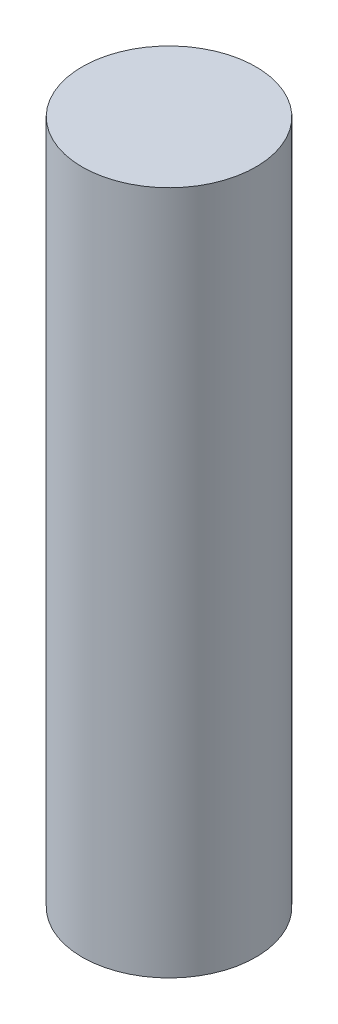
ISO-10303-21;
HEADER;
FILE_DESCRIPTION(('STEP AP214'),'2;1');
FILE_NAME('part.step','',(''),(''),'','','');
FILE_SCHEMA(('AUTOMOTIVE_DESIGN { 1 0 10303 214 1 1 1 1 }'));
ENDSEC;
DATA;
#1=APPLICATION_CONTEXT('core data for automotive mechanical design processes');
#2=APPLICATION_PROTOCOL_DEFINITION('international standard','automotive_design',2000,#1);
#3=PRODUCT_CONTEXT('',#1,'mechanical');
#4=PRODUCT('Part','Part','',(#3));
#5=PRODUCT_RELATED_PRODUCT_CATEGORY('part','',(#4));
#6=PRODUCT_DEFINITION_FORMATION('','',#4);
#7=PRODUCT_DEFINITION_CONTEXT('part definition',#1,'design');
#8=PRODUCT_DEFINITION('design','',#6,#7);
#9=PRODUCT_DEFINITION_SHAPE('','',#8);
#10=(LENGTH_UNIT() NAMED_UNIT(*) SI_UNIT(.MILLI.,.METRE.));
#11=(NAMED_UNIT(*) PLANE_ANGLE_UNIT() SI_UNIT($,.RADIAN.));
#12=(NAMED_UNIT(*) SI_UNIT($,.STERADIAN.) SOLID_ANGLE_UNIT());
#13=UNCERTAINTY_MEASURE_WITH_UNIT(LENGTH_MEASURE(1.E-05),#10,'distance_accuracy_value','');
#14=(GEOMETRIC_REPRESENTATION_CONTEXT(3) GLOBAL_UNCERTAINTY_ASSIGNED_CONTEXT((#13)) GLOBAL_UNIT_ASSIGNED_CONTEXT((#10,
#11,#12)) REPRESENTATION_CONTEXT('',''));
#15=CARTESIAN_POINT('',(0.,0.,0.));
#16=DIRECTION('',(0.,0.,1.));
#17=DIRECTION('',(1.,0.,0.));
#18=AXIS2_PLACEMENT_3D('',#15,#16,#17);
#19=CARTESIAN_POINT('',(0.,98.5,0.));
#20=DIRECTION('',(0.,-1.,0.));
#21=DIRECTION('',(0.,0.,-1.));
#22=AXIS2_PLACEMENT_3D('',#19,#20,#21);
#23=CYLINDRICAL_SURFACE('',#22,12.5);
#24=CARTESIAN_POINT('',(0.,98.5,0.));
#25=DIRECTION('',(0.,1.,0.));
#26=DIRECTION('',(0.,0.,1.));
#27=AXIS2_PLACEMENT_3D('',#24,#25,#26);
#28=CIRCLE('',#27,12.5);
#29=CARTESIAN_POINT('',(0.,98.5,12.5));
#30=VERTEX_POINT('',#29);
#31=EDGE_CURVE('E10',#30,#30,#28,.T.);
#32=ORIENTED_EDGE('',*,*,#31,.F.);
#33=EDGE_LOOP('',(#32));
#34=FACE_BOUND('',#33,.T.);
#35=CARTESIAN_POINT('',(0.,0.,0.));
#36=DIRECTION('',(0.,1.,0.));
#37=DIRECTION('',(0.,0.,1.));
#38=AXIS2_PLACEMENT_3D('',#35,#36,#37);
#39=CIRCLE('',#38,12.5);
#40=CARTESIAN_POINT('',(0.,0.,12.5));
#41=VERTEX_POINT('',#40);
#42=EDGE_CURVE('E46',#41,#41,#39,.T.);
#43=ORIENTED_EDGE('',*,*,#42,.T.);
#44=EDGE_LOOP('',(#43));
#45=FACE_BOUND('',#44,.T.);
#46=ADVANCED_FACE('F43',(#34,#45),#23,.T.);
#47=CARTESIAN_POINT('',(0.,98.5,0.));
#48=DIRECTION('',(0.,1.,0.));
#49=DIRECTION('',(0.,0.,1.));
#50=AXIS2_PLACEMENT_3D('',#47,#48,#49);
#51=PLANE('',#50);
#52=ORIENTED_EDGE('',*,*,#31,.T.);
#53=EDGE_LOOP('',(#52));
#54=FACE_BOUND('',#53,.T.);
#55=ADVANCED_FACE('F76',(#54),#51,.T.);
#56=CARTESIAN_POINT('',(0.,0.,0.));
#57=DIRECTION('',(0.,1.,0.));
#58=DIRECTION('',(0.,0.,1.));
#59=AXIS2_PLACEMENT_3D('',#56,#57,#58);
#60=PLANE('',#59);
#61=CARTESIAN_POINT('',(0.,0.,0.));
#62=DIRECTION('',(0.,-1.,0.));
#63=DIRECTION('',(0.,0.,-1.));
#64=AXIS2_PLACEMENT_3D('',#61,#62,#63);
#65=CIRCLE('',#64,3.175);
#66=CARTESIAN_POINT('',(0.,0.,-3.175));
#67=VERTEX_POINT('',#66);
#68=EDGE_CURVE('E57',#67,#67,#65,.T.);
#69=ORIENTED_EDGE('',*,*,#68,.F.);
#70=EDGE_LOOP('',(#69));
#71=FACE_BOUND('',#70,.T.);
#72=ORIENTED_EDGE('',*,*,#42,.F.);
#73=EDGE_LOOP('',(#72));
#74=FACE_BOUND('',#73,.T.);
#75=ADVANCED_FACE('F70',(#71,#74),#60,.F.);
#76=CARTESIAN_POINT('',(0.,10.,0.));
#77=DIRECTION('',(0.,-1.,0.));
#78=DIRECTION('',(0.,0.,-1.));
#79=AXIS2_PLACEMENT_3D('',#76,#77,#78);
#80=CYLINDRICAL_SURFACE('',#79,3.175);
#81=CARTESIAN_POINT('',(0.,10.,0.));
#82=DIRECTION('',(0.,-1.,0.));
#83=DIRECTION('',(0.,0.,-1.));
#84=AXIS2_PLACEMENT_3D('',#81,#82,#83);
#85=CIRCLE('',#84,3.175);
#86=CARTESIAN_POINT('',(0.,10.,-3.175));
#87=VERTEX_POINT('',#86);
#88=EDGE_CURVE('E55',#87,#87,#85,.T.);
#89=ORIENTED_EDGE('',*,*,#88,.F.);
#90=EDGE_LOOP('',(#89));
#91=FACE_BOUND('',#90,.T.);
#92=ORIENTED_EDGE('',*,*,#68,.T.);
#93=EDGE_LOOP('',(#92));
#94=FACE_BOUND('',#93,.T.);
#95=ADVANCED_FACE('F67',(#91,#94),#80,.F.);
#96=CARTESIAN_POINT('',(0.,10.,0.));
#97=DIRECTION('',(0.,-1.,0.));
#98=DIRECTION('',(0.,0.,-1.));
#99=AXIS2_PLACEMENT_3D('',#96,#97,#98);
#100=PLANE('',#99);
#101=ORIENTED_EDGE('',*,*,#88,.T.);
#102=EDGE_LOOP('',(#101));
#103=FACE_BOUND('',#102,.T.);
#104=ADVANCED_FACE('F65',(#103),#100,.T.);
#105=CLOSED_SHELL('',(#46,#55,#75,#95,#104));
#106=MANIFOLD_SOLID_BREP('B2',#105);
#107=ADVANCED_BREP_SHAPE_REPRESENTATION('',(#18,#106),#14);
#108=SHAPE_DEFINITION_REPRESENTATION(#9,#107);
ENDSEC;
END-ISO-10303-21;
